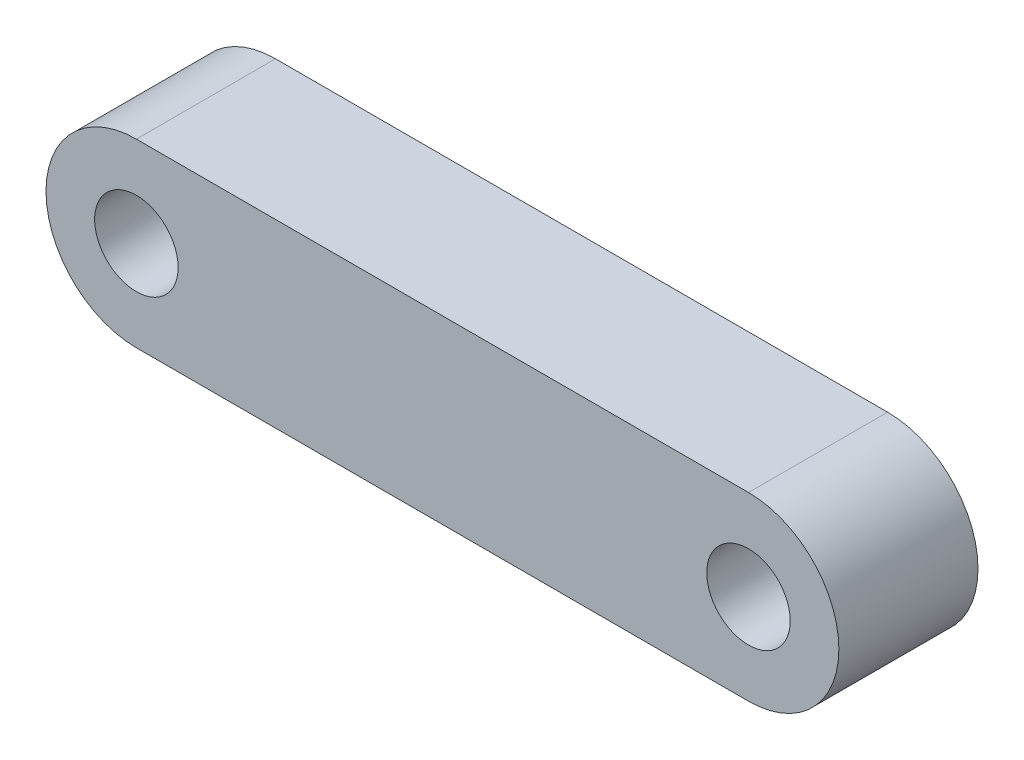
ISO-10303-21;
HEADER;
FILE_DESCRIPTION(('STEP AP214'),'2;1');
FILE_NAME('part.step','',(''),(''),'','','');
FILE_SCHEMA(('AUTOMOTIVE_DESIGN { 1 0 10303 214 1 1 1 1 }'));
ENDSEC;
DATA;
#1=APPLICATION_CONTEXT('core data for automotive mechanical design processes');
#2=APPLICATION_PROTOCOL_DEFINITION('international standard','automotive_design',2000,#1);
#3=PRODUCT_CONTEXT('',#1,'mechanical');
#4=PRODUCT('Part','Part','',(#3));
#5=PRODUCT_RELATED_PRODUCT_CATEGORY('part','',(#4));
#6=PRODUCT_DEFINITION_FORMATION('','',#4);
#7=PRODUCT_DEFINITION_CONTEXT('part definition',#1,'design');
#8=PRODUCT_DEFINITION('design','',#6,#7);
#9=PRODUCT_DEFINITION_SHAPE('','',#8);
#10=(LENGTH_UNIT() NAMED_UNIT(*) SI_UNIT(.MILLI.,.METRE.));
#11=(NAMED_UNIT(*) PLANE_ANGLE_UNIT() SI_UNIT($,.RADIAN.));
#12=(NAMED_UNIT(*) SI_UNIT($,.STERADIAN.) SOLID_ANGLE_UNIT());
#13=UNCERTAINTY_MEASURE_WITH_UNIT(LENGTH_MEASURE(1.E-05),#10,'distance_accuracy_value','');
#14=(GEOMETRIC_REPRESENTATION_CONTEXT(3) GLOBAL_UNCERTAINTY_ASSIGNED_CONTEXT((#13)) GLOBAL_UNIT_ASSIGNED_CONTEXT((#10,
#11,#12)) REPRESENTATION_CONTEXT('',''));
#15=CARTESIAN_POINT('',(0.,0.,0.));
#16=DIRECTION('',(0.,0.,1.));
#17=DIRECTION('',(1.,0.,0.));
#18=AXIS2_PLACEMENT_3D('',#15,#16,#17);
#19=CARTESIAN_POINT('',(2357.73943958804,1625.83583302904,5.));
#20=DIRECTION('',(0.,0.,1.));
#21=DIRECTION('',(1.,0.,0.));
#22=AXIS2_PLACEMENT_3D('',#19,#20,#21);
#23=PLANE('',#22);
#24=CARTESIAN_POINT('',(2357.73935708099,1625.83583302904,5.));
#25=DIRECTION('',(0.,0.,1.));
#26=DIRECTION('',(1.,0.,0.));
#27=AXIS2_PLACEMENT_3D('',#24,#25,#26);
#28=CIRCLE('',#27,1.50000000000011);
#29=CARTESIAN_POINT('',(2359.23935708099,1625.83583302904,5.));
#30=VERTEX_POINT('',#29);
#31=EDGE_CURVE('E112',#30,#30,#28,.T.);
#32=ORIENTED_EDGE('',*,*,#31,.F.);
#33=EDGE_LOOP('',(#32));
#34=FACE_BOUND('',#33,.T.);
#35=CARTESIAN_POINT('',(2357.73943958804,1625.83583302904,5.));
#36=DIRECTION('',(0.,0.,1.));
#37=DIRECTION('',(1.,0.,0.));
#38=AXIS2_PLACEMENT_3D('',#35,#36,#37);
#39=CIRCLE('',#38,3.24777769214709);
#40=CARTESIAN_POINT('',(2357.73935708099,1629.08361072014,5.));
#41=VERTEX_POINT('',#40);
#42=CARTESIAN_POINT('',(2357.73935708099,1622.58805533794,5.));
#43=VERTEX_POINT('',#42);
#44=EDGE_CURVE('E92',#41,#43,#39,.T.);
#45=ORIENTED_EDGE('',*,*,#44,.T.);
#46=DIRECTION('',(1.,0.,0.));
#47=VECTOR('',#46,1.);
#48=CARTESIAN_POINT('',(2357.73935708099,1622.58805533794,5.));
#49=LINE('',#48,#47);
#50=CARTESIAN_POINT('',(2379.73935708099,1622.58805533794,5.));
#51=VERTEX_POINT('',#50);
#52=EDGE_CURVE('E87',#43,#51,#49,.T.);
#53=ORIENTED_EDGE('',*,*,#52,.T.);
#54=CARTESIAN_POINT('',(2379.73931582063,1625.83638012807,5.));
#55=DIRECTION('',(0.,0.,1.));
#56=DIRECTION('',(1.,0.,0.));
#57=AXIS2_PLACEMENT_3D('',#54,#55,#56);
#58=CIRCLE('',#57,3.24832479038654);
#59=CARTESIAN_POINT('',(2379.73935708099,1629.08470491819,5.));
#60=VERTEX_POINT('',#59);
#61=EDGE_CURVE('E90',#51,#60,#58,.T.);
#62=ORIENTED_EDGE('',*,*,#61,.T.);
#63=DIRECTION('',(-0.999999998763151,-4.9736275067174E-05,0.));
#64=VECTOR('',#63,1.);
#65=CARTESIAN_POINT('',(2379.73935708099,1629.08470491819,5.));
#66=LINE('',#65,#64);
#67=EDGE_CURVE('E57',#60,#41,#66,.T.);
#68=ORIENTED_EDGE('',*,*,#67,.T.);
#69=EDGE_LOOP('',(#45,#53,#62,#68));
#70=FACE_BOUND('',#69,.T.);
#71=CARTESIAN_POINT('',(2379.73935708099,1625.83583302904,5.));
#72=DIRECTION('',(0.,0.,1.));
#73=DIRECTION('',(1.,0.,0.));
#74=AXIS2_PLACEMENT_3D('',#71,#72,#73);
#75=CIRCLE('',#74,1.50000000000011);
#76=CARTESIAN_POINT('',(2381.23935708099,1625.83583302904,5.));
#77=VERTEX_POINT('',#76);
#78=EDGE_CURVE('E134',#77,#77,#75,.T.);
#79=ORIENTED_EDGE('',*,*,#78,.F.);
#80=EDGE_LOOP('',(#79));
#81=FACE_BOUND('',#80,.T.);
#82=ADVANCED_FACE('F39',(#34,#70,#81),#23,.T.);
#83=CARTESIAN_POINT('',(2357.73943958804,1625.83583302904,0.));
#84=DIRECTION('',(0.,0.,1.));
#85=DIRECTION('',(1.,0.,0.));
#86=AXIS2_PLACEMENT_3D('',#83,#84,#85);
#87=PLANE('',#86);
#88=CARTESIAN_POINT('',(2357.73943958804,1625.83583302904,0.));
#89=DIRECTION('',(0.,0.,1.));
#90=DIRECTION('',(1.,0.,0.));
#91=AXIS2_PLACEMENT_3D('',#88,#89,#90);
#92=CIRCLE('',#91,3.24777769214709);
#93=CARTESIAN_POINT('',(2357.73935708099,1629.08361072014,0.));
#94=VERTEX_POINT('',#93);
#95=CARTESIAN_POINT('',(2357.73935708099,1622.58805533794,0.));
#96=VERTEX_POINT('',#95);
#97=EDGE_CURVE('E108',#94,#96,#92,.T.);
#98=ORIENTED_EDGE('',*,*,#97,.F.);
#99=DIRECTION('',(-0.999999998763151,-4.9736275067174E-05,0.));
#100=VECTOR('',#99,1.);
#101=CARTESIAN_POINT('',(2379.73935708099,1629.08470491819,0.));
#102=LINE('',#101,#100);
#103=CARTESIAN_POINT('',(2379.73935708099,1629.08470491819,0.));
#104=VERTEX_POINT('',#103);
#105=EDGE_CURVE('E80',#104,#94,#102,.T.);
#106=ORIENTED_EDGE('',*,*,#105,.F.);
#107=CARTESIAN_POINT('',(2379.73931582063,1625.83638012807,0.));
#108=DIRECTION('',(0.,0.,1.));
#109=DIRECTION('',(1.,0.,0.));
#110=AXIS2_PLACEMENT_3D('',#107,#108,#109);
#111=CIRCLE('',#110,3.24832479038654);
#112=CARTESIAN_POINT('',(2379.73935708099,1622.58805533794,0.));
#113=VERTEX_POINT('',#112);
#114=EDGE_CURVE('E74',#113,#104,#111,.T.);
#115=ORIENTED_EDGE('',*,*,#114,.F.);
#116=DIRECTION('',(1.,0.,0.));
#117=VECTOR('',#116,1.);
#118=CARTESIAN_POINT('',(2357.73935708099,1622.58805533794,0.));
#119=LINE('',#118,#117);
#120=EDGE_CURVE('E97',#96,#113,#119,.T.);
#121=ORIENTED_EDGE('',*,*,#120,.F.);
#122=EDGE_LOOP('',(#98,#106,#115,#121));
#123=FACE_BOUND('',#122,.T.);
#124=CARTESIAN_POINT('',(2357.73935708099,1625.83583302904,0.));
#125=DIRECTION('',(0.,0.,1.));
#126=DIRECTION('',(1.,0.,0.));
#127=AXIS2_PLACEMENT_3D('',#124,#125,#126);
#128=CIRCLE('',#127,1.50000000000011);
#129=CARTESIAN_POINT('',(2359.23935708099,1625.83583302904,0.));
#130=VERTEX_POINT('',#129);
#131=EDGE_CURVE('E130',#130,#130,#128,.T.);
#132=ORIENTED_EDGE('',*,*,#131,.T.);
#133=EDGE_LOOP('',(#132));
#134=FACE_BOUND('',#133,.T.);
#135=CARTESIAN_POINT('',(2379.73935708099,1625.83583302904,0.));
#136=DIRECTION('',(0.,0.,1.));
#137=DIRECTION('',(1.,0.,0.));
#138=AXIS2_PLACEMENT_3D('',#135,#136,#137);
#139=CIRCLE('',#138,1.50000000000011);
#140=CARTESIAN_POINT('',(2381.23935708099,1625.83583302904,0.));
#141=VERTEX_POINT('',#140);
#142=EDGE_CURVE('E138',#141,#141,#139,.T.);
#143=ORIENTED_EDGE('',*,*,#142,.T.);
#144=EDGE_LOOP('',(#143));
#145=FACE_BOUND('',#144,.T.);
#146=ADVANCED_FACE('F125',(#123,#134,#145),#87,.F.);
#147=CARTESIAN_POINT('',(2357.73943958804,1625.83583302904,5.));
#148=DIRECTION('',(0.,0.,-1.));
#149=DIRECTION('',(-1.,0.,0.));
#150=AXIS2_PLACEMENT_3D('',#147,#148,#149);
#151=CYLINDRICAL_SURFACE('',#150,3.24777769214709);
#152=ORIENTED_EDGE('',*,*,#97,.T.);
#153=DIRECTION('',(0.,0.,-1.));
#154=VECTOR('',#153,1.);
#155=CARTESIAN_POINT('',(2357.73935708099,1622.58805533794,5.));
#156=LINE('',#155,#154);
#157=EDGE_CURVE('E11',#43,#96,#156,.T.);
#158=ORIENTED_EDGE('',*,*,#157,.F.);
#159=ORIENTED_EDGE('',*,*,#44,.F.);
#160=DIRECTION('',(0.,0.,-1.));
#161=VECTOR('',#160,1.);
#162=CARTESIAN_POINT('',(2357.73935708099,1629.08361072014,5.));
#163=LINE('',#162,#161);
#164=EDGE_CURVE('E104',#41,#94,#163,.T.);
#165=ORIENTED_EDGE('',*,*,#164,.T.);
#166=EDGE_LOOP('',(#152,#158,#159,#165));
#167=FACE_BOUND('',#166,.T.);
#168=ADVANCED_FACE('F41',(#167),#151,.T.);
#169=CARTESIAN_POINT('',(2357.73935708099,1622.58805533794,5.));
#170=DIRECTION('',(0.,1.,0.));
#171=DIRECTION('',(-1.,0.,0.));
#172=AXIS2_PLACEMENT_3D('',#169,#170,#171);
#173=PLANE('',#172);
#174=ORIENTED_EDGE('',*,*,#120,.T.);
#175=DIRECTION('',(0.,0.,-1.));
#176=VECTOR('',#175,1.);
#177=CARTESIAN_POINT('',(2379.73935708099,1622.58805533794,5.));
#178=LINE('',#177,#176);
#179=EDGE_CURVE('E49',#51,#113,#178,.T.);
#180=ORIENTED_EDGE('',*,*,#179,.F.);
#181=ORIENTED_EDGE('',*,*,#52,.F.);
#182=ORIENTED_EDGE('',*,*,#157,.T.);
#183=EDGE_LOOP('',(#174,#180,#181,#182));
#184=FACE_BOUND('',#183,.T.);
#185=ADVANCED_FACE('F96',(#184),#173,.F.);
#186=CARTESIAN_POINT('',(2379.73931582063,1625.83638012807,5.));
#187=DIRECTION('',(0.,0.,-1.));
#188=DIRECTION('',(-1.,0.,0.));
#189=AXIS2_PLACEMENT_3D('',#186,#187,#188);
#190=CYLINDRICAL_SURFACE('',#189,3.24832479038654);
#191=ORIENTED_EDGE('',*,*,#114,.T.);
#192=DIRECTION('',(0.,0.,-1.));
#193=VECTOR('',#192,1.);
#194=CARTESIAN_POINT('',(2379.73935708099,1629.08470491819,5.));
#195=LINE('',#194,#193);
#196=EDGE_CURVE('E99',#60,#104,#195,.T.);
#197=ORIENTED_EDGE('',*,*,#196,.F.);
#198=ORIENTED_EDGE('',*,*,#61,.F.);
#199=ORIENTED_EDGE('',*,*,#179,.T.);
#200=EDGE_LOOP('',(#191,#197,#198,#199));
#201=FACE_BOUND('',#200,.T.);
#202=ADVANCED_FACE('F100',(#201),#190,.T.);
#203=CARTESIAN_POINT('',(2379.73935708099,1629.08470491819,5.));
#204=DIRECTION('',(4.9736275067174E-05,-0.999999998763152,0.));
#205=DIRECTION('',(0.999999998763152,4.9736275067174E-05,0.));
#206=AXIS2_PLACEMENT_3D('',#203,#204,#205);
#207=PLANE('',#206);
#208=ORIENTED_EDGE('',*,*,#105,.T.);
#209=ORIENTED_EDGE('',*,*,#164,.F.);
#210=ORIENTED_EDGE('',*,*,#67,.F.);
#211=ORIENTED_EDGE('',*,*,#196,.T.);
#212=EDGE_LOOP('',(#208,#209,#210,#211));
#213=FACE_BOUND('',#212,.T.);
#214=ADVANCED_FACE('F122',(#213),#207,.F.);
#215=CARTESIAN_POINT('',(2357.73935708099,1625.83583302904,5.));
#216=DIRECTION('',(0.,0.,-1.));
#217=DIRECTION('',(-1.,0.,0.));
#218=AXIS2_PLACEMENT_3D('',#215,#216,#217);
#219=CYLINDRICAL_SURFACE('',#218,1.50000000000011);
#220=ORIENTED_EDGE('',*,*,#31,.T.);
#221=EDGE_LOOP('',(#220));
#222=FACE_BOUND('',#221,.T.);
#223=ORIENTED_EDGE('',*,*,#131,.F.);
#224=EDGE_LOOP('',(#223));
#225=FACE_BOUND('',#224,.T.);
#226=ADVANCED_FACE('F157',(#222,#225),#219,.F.);
#227=CARTESIAN_POINT('',(2379.73935708099,1625.83583302904,5.));
#228=DIRECTION('',(0.,0.,-1.));
#229=DIRECTION('',(-1.,0.,0.));
#230=AXIS2_PLACEMENT_3D('',#227,#228,#229);
#231=CYLINDRICAL_SURFACE('',#230,1.50000000000011);
#232=ORIENTED_EDGE('',*,*,#78,.T.);
#233=EDGE_LOOP('',(#232));
#234=FACE_BOUND('',#233,.T.);
#235=ORIENTED_EDGE('',*,*,#142,.F.);
#236=EDGE_LOOP('',(#235));
#237=FACE_BOUND('',#236,.T.);
#238=ADVANCED_FACE('F146',(#234,#237),#231,.F.);
#239=CLOSED_SHELL('',(#82,#146,#168,#185,#202,#214,#226,#238));
#240=MANIFOLD_SOLID_BREP('B2',#239);
#241=ADVANCED_BREP_SHAPE_REPRESENTATION('',(#18,#240),#14);
#242=SHAPE_DEFINITION_REPRESENTATION(#9,#241);
ENDSEC;
END-ISO-10303-21;
